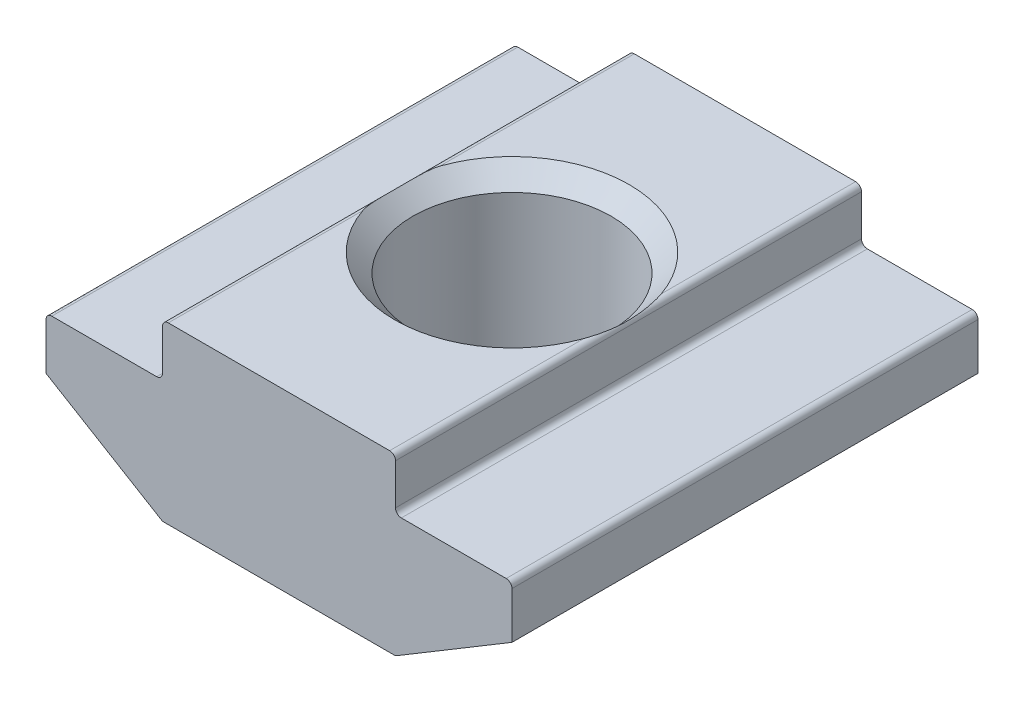
ISO-10303-21;
HEADER;
FILE_DESCRIPTION(('STEP AP214'),'2;1');
FILE_NAME('part.step','',(''),(''),'','','');
FILE_SCHEMA(('AUTOMOTIVE_DESIGN { 1 0 10303 214 1 1 1 1 }'));
ENDSEC;
DATA;
#1=APPLICATION_CONTEXT('core data for automotive mechanical design processes');
#2=APPLICATION_PROTOCOL_DEFINITION('international standard','automotive_design',2000,#1);
#3=PRODUCT_CONTEXT('',#1,'mechanical');
#4=PRODUCT('Part','Part','',(#3));
#5=PRODUCT_RELATED_PRODUCT_CATEGORY('part','',(#4));
#6=PRODUCT_DEFINITION_FORMATION('','',#4);
#7=PRODUCT_DEFINITION_CONTEXT('part definition',#1,'design');
#8=PRODUCT_DEFINITION('design','',#6,#7);
#9=PRODUCT_DEFINITION_SHAPE('','',#8);
#10=(LENGTH_UNIT() NAMED_UNIT(*) SI_UNIT(.MILLI.,.METRE.));
#11=(NAMED_UNIT(*) PLANE_ANGLE_UNIT() SI_UNIT($,.RADIAN.));
#12=(NAMED_UNIT(*) SI_UNIT($,.STERADIAN.) SOLID_ANGLE_UNIT());
#13=UNCERTAINTY_MEASURE_WITH_UNIT(LENGTH_MEASURE(1.E-05),#10,'distance_accuracy_value','');
#14=(GEOMETRIC_REPRESENTATION_CONTEXT(3) GLOBAL_UNCERTAINTY_ASSIGNED_CONTEXT((#13)) GLOBAL_UNIT_ASSIGNED_CONTEXT((#10,
#11,#12)) REPRESENTATION_CONTEXT('',''));
#15=CARTESIAN_POINT('',(0.,0.,0.));
#16=DIRECTION('',(0.,0.,1.));
#17=DIRECTION('',(1.,0.,0.));
#18=AXIS2_PLACEMENT_3D('',#15,#16,#17);
#19=CARTESIAN_POINT('',(-4.,-6.,8.));
#20=DIRECTION('',(0.,1.,0.));
#21=DIRECTION('',(0.,0.,1.));
#22=AXIS2_PLACEMENT_3D('',#19,#20,#21);
#23=PLANE('',#22);
#24=DIRECTION('',(1.,0.,0.));
#25=VECTOR('',#24,1.);
#26=CARTESIAN_POINT('',(-4.,-6.,-8.));
#27=LINE('',#26,#25);
#28=CARTESIAN_POINT('',(-3.94460320701031,-6.,-8.));
#29=VERTEX_POINT('',#28);
#30=CARTESIAN_POINT('',(3.94460320701031,-6.,-8.));
#31=VERTEX_POINT('',#30);
#32=EDGE_CURVE('E244',#29,#31,#27,.T.);
#33=ORIENTED_EDGE('',*,*,#32,.T.);
#34=DIRECTION('',(0.,0.,-1.));
#35=VECTOR('',#34,1.);
#36=CARTESIAN_POINT('',(3.94460320701031,-6.,-4.40022822840348));
#37=LINE('',#36,#35);
#38=CARTESIAN_POINT('',(3.94460320701031,-6.,-0.800456456806965));
#39=VERTEX_POINT('',#38);
#40=EDGE_CURVE('E285',#31,#39,#37,.F.);
#41=ORIENTED_EDGE('',*,*,#40,.T.);
#42=CARTESIAN_POINT('',(0.,-6.,0.));
#43=DIRECTION('',(0.,1.,0.));
#44=DIRECTION('',(0.,0.,1.));
#45=AXIS2_PLACEMENT_3D('',#42,#43,#44);
#46=CIRCLE('',#45,4.025);
#47=CARTESIAN_POINT('',(-3.94460320701031,-6.,-0.800456456806965));
#48=VERTEX_POINT('',#47);
#49=EDGE_CURVE('E266',#39,#48,#46,.T.);
#50=ORIENTED_EDGE('',*,*,#49,.T.);
#51=DIRECTION('',(0.,0.,-1.));
#52=VECTOR('',#51,1.);
#53=CARTESIAN_POINT('',(-3.94460320701031,-6.,-4.40022822840348));
#54=LINE('',#53,#52);
#55=EDGE_CURVE('E283',#48,#29,#54,.T.);
#56=ORIENTED_EDGE('',*,*,#55,.T.);
#57=EDGE_LOOP('',(#33,#41,#50,#56));
#58=FACE_BOUND('',#57,.T.);
#59=ADVANCED_FACE('F37',(#58),#23,.F.);
#60=CARTESIAN_POINT('',(4.,0.,8.));
#61=DIRECTION('',(0.,-1.,0.));
#62=DIRECTION('',(1.,0.,0.));
#63=AXIS2_PLACEMENT_3D('',#60,#61,#62);
#64=PLANE('',#63);
#65=CARTESIAN_POINT('',(0.,0.,0.));
#66=DIRECTION('',(0.,1.,0.));
#67=DIRECTION('',(0.,0.,1.));
#68=AXIS2_PLACEMENT_3D('',#65,#66,#67);
#69=CIRCLE('',#68,4.025);
#70=CARTESIAN_POINT('',(3.8,0.,-1.32688545097156));
#71=VERTEX_POINT('',#70);
#72=CARTESIAN_POINT('',(-3.8,0.,-1.32688545097156));
#73=VERTEX_POINT('',#72);
#74=EDGE_CURVE('E267',#71,#73,#69,.T.);
#75=ORIENTED_EDGE('',*,*,#74,.F.);
#76=DIRECTION('',(0.,0.,-1.));
#77=VECTOR('',#76,1.);
#78=CARTESIAN_POINT('',(3.8,0.,-4.66344272548578));
#79=LINE('',#78,#77);
#80=CARTESIAN_POINT('',(3.8,0.,-8.));
#81=VERTEX_POINT('',#80);
#82=EDGE_CURVE('E482',#71,#81,#79,.T.);
#83=ORIENTED_EDGE('',*,*,#82,.T.);
#84=DIRECTION('',(-1.,0.,0.));
#85=VECTOR('',#84,1.);
#86=CARTESIAN_POINT('',(4.,0.,-8.));
#87=LINE('',#86,#85);
#88=CARTESIAN_POINT('',(-3.8,0.,-8.));
#89=VERTEX_POINT('',#88);
#90=EDGE_CURVE('E258',#81,#89,#87,.T.);
#91=ORIENTED_EDGE('',*,*,#90,.T.);
#92=DIRECTION('',(0.,0.,-1.));
#93=VECTOR('',#92,1.);
#94=CARTESIAN_POINT('',(-3.8,0.,-4.66344272548578));
#95=LINE('',#94,#93);
#96=EDGE_CURVE('E52',#89,#73,#95,.F.);
#97=ORIENTED_EDGE('',*,*,#96,.T.);
#98=EDGE_LOOP('',(#75,#83,#91,#97));
#99=FACE_BOUND('',#98,.T.);
#100=ADVANCED_FACE('F322',(#99),#64,.F.);
#101=DIRECTION('',(-1.,0.,0.));
#102=VECTOR('',#101,1.);
#103=CARTESIAN_POINT('',(4.,0.,8.));
#104=LINE('',#103,#102);
#105=CARTESIAN_POINT('',(3.8,0.,8.));
#106=VERTEX_POINT('',#105);
#107=CARTESIAN_POINT('',(-3.8,0.,8.));
#108=VERTEX_POINT('',#107);
#109=EDGE_CURVE('E231',#106,#108,#104,.T.);
#110=ORIENTED_EDGE('',*,*,#109,.F.);
#111=DIRECTION('',(0.,0.,-1.));
#112=VECTOR('',#111,1.);
#113=CARTESIAN_POINT('',(3.8,0.,8.));
#114=LINE('',#113,#112);
#115=CARTESIAN_POINT('',(3.8,0.,1.32688545097156));
#116=VERTEX_POINT('',#115);
#117=EDGE_CURVE('E416',#106,#116,#114,.T.);
#118=ORIENTED_EDGE('',*,*,#117,.T.);
#119=CARTESIAN_POINT('',(-3.8,0.,1.32688545097156));
#120=VERTEX_POINT('',#119);
#121=EDGE_CURVE('E209',#120,#116,#69,.T.);
#122=ORIENTED_EDGE('',*,*,#121,.F.);
#123=DIRECTION('',(0.,0.,-1.));
#124=VECTOR('',#123,1.);
#125=CARTESIAN_POINT('',(-3.8,0.,8.));
#126=LINE('',#125,#124);
#127=EDGE_CURVE('E414',#120,#108,#126,.F.);
#128=ORIENTED_EDGE('',*,*,#127,.T.);
#129=EDGE_LOOP('',(#110,#118,#122,#128));
#130=FACE_BOUND('',#129,.T.);
#131=ADVANCED_FACE('F325',(#130),#64,.F.);
#132=CARTESIAN_POINT('',(-4.,0.,8.));
#133=DIRECTION('',(1.,0.,0.));
#134=DIRECTION('',(0.,0.,-1.));
#135=AXIS2_PLACEMENT_3D('',#132,#133,#134);
#136=PLANE('',#135);
#137=DIRECTION('',(0.,-1.,0.));
#138=VECTOR('',#137,1.);
#139=CARTESIAN_POINT('',(-4.,0.,8.));
#140=LINE('',#139,#138);
#141=CARTESIAN_POINT('',(-4.,-0.200000000000002,8.));
#142=VERTEX_POINT('',#141);
#143=CARTESIAN_POINT('',(-4.,-1.6,8.));
#144=VERTEX_POINT('',#143);
#145=EDGE_CURVE('E260',#142,#144,#140,.T.);
#146=ORIENTED_EDGE('',*,*,#145,.F.);
#147=DIRECTION('',(0.,0.,-1.));
#148=VECTOR('',#147,1.);
#149=CARTESIAN_POINT('',(-4.,-0.200000000000002,8.));
#150=LINE('',#149,#148);
#151=CARTESIAN_POINT('',(-4.,-0.200000000000002,-8.));
#152=VERTEX_POINT('',#151);
#153=EDGE_CURVE('E463',#142,#152,#150,.T.);
#154=ORIENTED_EDGE('',*,*,#153,.T.);
#155=DIRECTION('',(0.,-1.,0.));
#156=VECTOR('',#155,1.);
#157=CARTESIAN_POINT('',(-4.,0.,-8.));
#158=LINE('',#157,#156);
#159=CARTESIAN_POINT('',(-4.,-1.6,-8.));
#160=VERTEX_POINT('',#159);
#161=EDGE_CURVE('E234',#152,#160,#158,.T.);
#162=ORIENTED_EDGE('',*,*,#161,.T.);
#163=DIRECTION('',(0.,0.,-1.));
#164=VECTOR('',#163,1.);
#165=CARTESIAN_POINT('',(-4.,-1.6,8.));
#166=LINE('',#165,#164);
#167=EDGE_CURVE('E467',#160,#144,#166,.F.);
#168=ORIENTED_EDGE('',*,*,#167,.T.);
#169=EDGE_LOOP('',(#146,#154,#162,#168));
#170=FACE_BOUND('',#169,.T.);
#171=ADVANCED_FACE('F352',(#170),#136,.F.);
#172=CARTESIAN_POINT('',(-4.,-1.8,8.));
#173=DIRECTION('',(0.,-1.,0.));
#174=DIRECTION('',(1.,0.,0.));
#175=AXIS2_PLACEMENT_3D('',#172,#173,#174);
#176=PLANE('',#175);
#177=DIRECTION('',(-1.,0.,0.));
#178=VECTOR('',#177,1.);
#179=CARTESIAN_POINT('',(-4.,-1.8,-8.));
#180=LINE('',#179,#178);
#181=CARTESIAN_POINT('',(-4.2,-1.8,-8.));
#182=VERTEX_POINT('',#181);
#183=CARTESIAN_POINT('',(-7.8,-1.8,-8.));
#184=VERTEX_POINT('',#183);
#185=EDGE_CURVE('E237',#182,#184,#180,.T.);
#186=ORIENTED_EDGE('',*,*,#185,.T.);
#187=DIRECTION('',(0.,0.,-1.));
#188=VECTOR('',#187,1.);
#189=CARTESIAN_POINT('',(-7.8,-1.8,8.));
#190=LINE('',#189,#188);
#191=CARTESIAN_POINT('',(-7.8,-1.8,8.));
#192=VERTEX_POINT('',#191);
#193=EDGE_CURVE('E460',#184,#192,#190,.F.);
#194=ORIENTED_EDGE('',*,*,#193,.T.);
#195=DIRECTION('',(-1.,0.,0.));
#196=VECTOR('',#195,1.);
#197=CARTESIAN_POINT('',(-4.,-1.8,8.));
#198=LINE('',#197,#196);
#199=CARTESIAN_POINT('',(-4.2,-1.8,8.));
#200=VERTEX_POINT('',#199);
#201=EDGE_CURVE('E199',#200,#192,#198,.T.);
#202=ORIENTED_EDGE('',*,*,#201,.F.);
#203=DIRECTION('',(0.,0.,-1.));
#204=VECTOR('',#203,1.);
#205=CARTESIAN_POINT('',(-4.2,-1.8,-8.));
#206=LINE('',#205,#204);
#207=EDGE_CURVE('E462',#200,#182,#206,.T.);
#208=ORIENTED_EDGE('',*,*,#207,.T.);
#209=EDGE_LOOP('',(#186,#194,#202,#208));
#210=FACE_BOUND('',#209,.T.);
#211=ADVANCED_FACE('F349',(#210),#176,.F.);
#212=CARTESIAN_POINT('',(-8.,-1.8,8.));
#213=DIRECTION('',(1.,0.,0.));
#214=DIRECTION('',(0.,0.,-1.));
#215=AXIS2_PLACEMENT_3D('',#212,#213,#214);
#216=PLANE('',#215);
#217=DIRECTION('',(0.,-1.,0.));
#218=VECTOR('',#217,1.);
#219=CARTESIAN_POINT('',(-8.,-1.8,8.));
#220=LINE('',#219,#218);
#221=CARTESIAN_POINT('',(-8.,-2.,8.));
#222=VERTEX_POINT('',#221);
#223=CARTESIAN_POINT('',(-8.,-3.6,8.));
#224=VERTEX_POINT('',#223);
#225=EDGE_CURVE('E186',#222,#224,#220,.T.);
#226=ORIENTED_EDGE('',*,*,#225,.F.);
#227=DIRECTION('',(0.,0.,-1.));
#228=VECTOR('',#227,1.);
#229=CARTESIAN_POINT('',(-8.,-2.,8.));
#230=LINE('',#229,#228);
#231=CARTESIAN_POINT('',(-8.,-2.,-8.));
#232=VERTEX_POINT('',#231);
#233=EDGE_CURVE('E461',#222,#232,#230,.T.);
#234=ORIENTED_EDGE('',*,*,#233,.T.);
#235=DIRECTION('',(0.,-1.,0.));
#236=VECTOR('',#235,1.);
#237=CARTESIAN_POINT('',(-8.,-1.8,-8.));
#238=LINE('',#237,#236);
#239=CARTESIAN_POINT('',(-8.,-3.6,-8.));
#240=VERTEX_POINT('',#239);
#241=EDGE_CURVE('E205',#232,#240,#238,.T.);
#242=ORIENTED_EDGE('',*,*,#241,.T.);
#243=DIRECTION('',(0.,0.,-1.));
#244=VECTOR('',#243,1.);
#245=CARTESIAN_POINT('',(-8.,-3.6,8.));
#246=LINE('',#245,#244);
#247=EDGE_CURVE('E202',#224,#240,#246,.T.);
#248=ORIENTED_EDGE('',*,*,#247,.F.);
#249=EDGE_LOOP('',(#226,#234,#242,#248));
#250=FACE_BOUND('',#249,.T.);
#251=ADVANCED_FACE('F203',(#250),#216,.F.);
#252=CARTESIAN_POINT('',(-8.,-3.6,8.));
#253=DIRECTION('',(0.514495755427527,0.857492925712544,0.));
#254=DIRECTION('',(-0.857492925712544,0.514495755427527,0.));
#255=AXIS2_PLACEMENT_3D('',#252,#253,#254);
#256=PLANE('',#255);
#257=DIRECTION('',(0.857492925712544,-0.514495755427527,0.));
#258=VECTOR('',#257,1.);
#259=CARTESIAN_POINT('',(-8.,-3.6,-8.));
#260=LINE('',#259,#258);
#261=CARTESIAN_POINT('',(-4.04750235809582,-5.97149858514251,-8.));
#262=VERTEX_POINT('',#261);
#263=EDGE_CURVE('E242',#240,#262,#260,.T.);
#264=ORIENTED_EDGE('',*,*,#263,.T.);
#265=DIRECTION('',(0.,0.,-1.));
#266=VECTOR('',#265,1.);
#267=CARTESIAN_POINT('',(-4.04750235809582,-5.97149858514251,8.));
#268=LINE('',#267,#266);
#269=CARTESIAN_POINT('',(-4.04750235809582,-5.97149858514251,8.));
#270=VERTEX_POINT('',#269);
#271=EDGE_CURVE('E214',#262,#270,#268,.F.);
#272=ORIENTED_EDGE('',*,*,#271,.T.);
#273=DIRECTION('',(0.857492925712544,-0.514495755427527,0.));
#274=VECTOR('',#273,1.);
#275=CARTESIAN_POINT('',(-8.,-3.6,8.));
#276=LINE('',#275,#274);
#277=EDGE_CURVE('E191',#224,#270,#276,.T.);
#278=ORIENTED_EDGE('',*,*,#277,.F.);
#279=ORIENTED_EDGE('',*,*,#247,.T.);
#280=EDGE_LOOP('',(#264,#272,#278,#279));
#281=FACE_BOUND('',#280,.T.);
#282=ADVANCED_FACE('F212',(#281),#256,.F.);
#283=CARTESIAN_POINT('',(-3.94460320701031,-6.,0.800456456806965));
#284=VERTEX_POINT('',#283);
#285=CARTESIAN_POINT('',(3.94460320701031,-6.,0.800456456806965));
#286=VERTEX_POINT('',#285);
#287=EDGE_CURVE('E263',#284,#286,#46,.T.);
#288=ORIENTED_EDGE('',*,*,#287,.T.);
#289=DIRECTION('',(0.,0.,-1.));
#290=VECTOR('',#289,1.);
#291=CARTESIAN_POINT('',(3.94460320701031,-6.,8.));
#292=LINE('',#291,#290);
#293=CARTESIAN_POINT('',(3.94460320701031,-6.,8.));
#294=VERTEX_POINT('',#293);
#295=EDGE_CURVE('E381',#286,#294,#292,.F.);
#296=ORIENTED_EDGE('',*,*,#295,.T.);
#297=DIRECTION('',(1.,0.,0.));
#298=VECTOR('',#297,1.);
#299=CARTESIAN_POINT('',(-4.,-6.,8.));
#300=LINE('',#299,#298);
#301=CARTESIAN_POINT('',(-3.94460320701031,-6.,8.));
#302=VERTEX_POINT('',#301);
#303=EDGE_CURVE('E215',#302,#294,#300,.T.);
#304=ORIENTED_EDGE('',*,*,#303,.F.);
#305=DIRECTION('',(0.,0.,-1.));
#306=VECTOR('',#305,1.);
#307=CARTESIAN_POINT('',(-3.94460320701031,-6.,8.));
#308=LINE('',#307,#306);
#309=EDGE_CURVE('E384',#302,#284,#308,.T.);
#310=ORIENTED_EDGE('',*,*,#309,.T.);
#311=EDGE_LOOP('',(#288,#296,#304,#310));
#312=FACE_BOUND('',#311,.T.);
#313=ADVANCED_FACE('F340',(#312),#23,.F.);
#314=CARTESIAN_POINT('',(8.,-3.6,8.));
#315=DIRECTION('',(-0.514495755427527,0.857492925712544,0.));
#316=DIRECTION('',(-0.857492925712544,-0.514495755427527,0.));
#317=AXIS2_PLACEMENT_3D('',#314,#315,#316);
#318=PLANE('',#317);
#319=DIRECTION('',(0.857492925712544,0.514495755427527,0.));
#320=VECTOR('',#319,1.);
#321=CARTESIAN_POINT('',(8.,-3.6,8.));
#322=LINE('',#321,#320);
#323=CARTESIAN_POINT('',(4.04750235809582,-5.97149858514251,8.));
#324=VERTEX_POINT('',#323);
#325=CARTESIAN_POINT('',(8.,-3.6,8.));
#326=VERTEX_POINT('',#325);
#327=EDGE_CURVE('E217',#324,#326,#322,.T.);
#328=ORIENTED_EDGE('',*,*,#327,.F.);
#329=DIRECTION('',(0.,0.,-1.));
#330=VECTOR('',#329,1.);
#331=CARTESIAN_POINT('',(4.04750235809582,-5.97149858514251,8.));
#332=LINE('',#331,#330);
#333=CARTESIAN_POINT('',(4.04750235809582,-5.97149858514251,-8.));
#334=VERTEX_POINT('',#333);
#335=EDGE_CURVE('E268',#324,#334,#332,.T.);
#336=ORIENTED_EDGE('',*,*,#335,.T.);
#337=DIRECTION('',(0.857492925712544,0.514495755427527,0.));
#338=VECTOR('',#337,1.);
#339=CARTESIAN_POINT('',(8.,-3.6,-8.));
#340=LINE('',#339,#338);
#341=CARTESIAN_POINT('',(8.,-3.6,-8.));
#342=VERTEX_POINT('',#341);
#343=EDGE_CURVE('E247',#334,#342,#340,.T.);
#344=ORIENTED_EDGE('',*,*,#343,.T.);
#345=DIRECTION('',(0.,0.,-1.));
#346=VECTOR('',#345,1.);
#347=CARTESIAN_POINT('',(8.,-3.6,8.));
#348=LINE('',#347,#346);
#349=EDGE_CURVE('E210',#326,#342,#348,.T.);
#350=ORIENTED_EDGE('',*,*,#349,.F.);
#351=EDGE_LOOP('',(#328,#336,#344,#350));
#352=FACE_BOUND('',#351,.T.);
#353=ADVANCED_FACE('F336',(#352),#318,.F.);
#354=CARTESIAN_POINT('',(8.,-1.8,8.));
#355=DIRECTION('',(-1.,0.,0.));
#356=DIRECTION('',(0.,0.,1.));
#357=AXIS2_PLACEMENT_3D('',#354,#355,#356);
#358=PLANE('',#357);
#359=DIRECTION('',(0.,1.,0.));
#360=VECTOR('',#359,1.);
#361=CARTESIAN_POINT('',(8.,-1.8,-8.));
#362=LINE('',#361,#360);
#363=CARTESIAN_POINT('',(8.,-2.,-8.));
#364=VERTEX_POINT('',#363);
#365=EDGE_CURVE('E249',#342,#364,#362,.T.);
#366=ORIENTED_EDGE('',*,*,#365,.T.);
#367=DIRECTION('',(0.,0.,-1.));
#368=VECTOR('',#367,1.);
#369=CARTESIAN_POINT('',(8.,-2.,8.));
#370=LINE('',#369,#368);
#371=CARTESIAN_POINT('',(8.,-2.,8.));
#372=VERTEX_POINT('',#371);
#373=EDGE_CURVE('E407',#364,#372,#370,.F.);
#374=ORIENTED_EDGE('',*,*,#373,.T.);
#375=DIRECTION('',(0.,1.,0.));
#376=VECTOR('',#375,1.);
#377=CARTESIAN_POINT('',(8.,-1.8,8.));
#378=LINE('',#377,#376);
#379=EDGE_CURVE('E222',#326,#372,#378,.T.);
#380=ORIENTED_EDGE('',*,*,#379,.F.);
#381=ORIENTED_EDGE('',*,*,#349,.T.);
#382=EDGE_LOOP('',(#366,#374,#380,#381));
#383=FACE_BOUND('',#382,.T.);
#384=ADVANCED_FACE('F332',(#383),#358,.F.);
#385=CARTESIAN_POINT('',(4.,-1.8,8.));
#386=DIRECTION('',(0.,-1.,0.));
#387=DIRECTION('',(1.,0.,0.));
#388=AXIS2_PLACEMENT_3D('',#385,#386,#387);
#389=PLANE('',#388);
#390=DIRECTION('',(-1.,0.,0.));
#391=VECTOR('',#390,1.);
#392=CARTESIAN_POINT('',(4.,-1.8,8.));
#393=LINE('',#392,#391);
#394=CARTESIAN_POINT('',(7.8,-1.8,8.));
#395=VERTEX_POINT('',#394);
#396=CARTESIAN_POINT('',(4.2,-1.8,8.));
#397=VERTEX_POINT('',#396);
#398=EDGE_CURVE('E225',#395,#397,#393,.T.);
#399=ORIENTED_EDGE('',*,*,#398,.F.);
#400=DIRECTION('',(0.,0.,-1.));
#401=VECTOR('',#400,1.);
#402=CARTESIAN_POINT('',(7.8,-1.8,8.));
#403=LINE('',#402,#401);
#404=CARTESIAN_POINT('',(7.8,-1.8,-8.));
#405=VERTEX_POINT('',#404);
#406=EDGE_CURVE('E404',#395,#405,#403,.T.);
#407=ORIENTED_EDGE('',*,*,#406,.T.);
#408=DIRECTION('',(-1.,0.,0.));
#409=VECTOR('',#408,1.);
#410=CARTESIAN_POINT('',(4.,-1.8,-8.));
#411=LINE('',#410,#409);
#412=CARTESIAN_POINT('',(4.2,-1.8,-8.));
#413=VERTEX_POINT('',#412);
#414=EDGE_CURVE('E252',#405,#413,#411,.T.);
#415=ORIENTED_EDGE('',*,*,#414,.T.);
#416=DIRECTION('',(0.,0.,-1.));
#417=VECTOR('',#416,1.);
#418=CARTESIAN_POINT('',(4.2,-1.8,8.));
#419=LINE('',#418,#417);
#420=EDGE_CURVE('E402',#413,#397,#419,.F.);
#421=ORIENTED_EDGE('',*,*,#420,.T.);
#422=EDGE_LOOP('',(#399,#407,#415,#421));
#423=FACE_BOUND('',#422,.T.);
#424=ADVANCED_FACE('F328',(#423),#389,.F.);
#425=CARTESIAN_POINT('',(4.,0.,8.));
#426=DIRECTION('',(-1.,0.,0.));
#427=DIRECTION('',(0.,0.,1.));
#428=AXIS2_PLACEMENT_3D('',#425,#426,#427);
#429=PLANE('',#428);
#430=DIRECTION('',(0.,1.,0.));
#431=VECTOR('',#430,1.);
#432=CARTESIAN_POINT('',(4.,0.,8.));
#433=LINE('',#432,#431);
#434=CARTESIAN_POINT('',(4.,-1.6,8.));
#435=VERTEX_POINT('',#434);
#436=CARTESIAN_POINT('',(4.,-0.199999999999998,8.));
#437=VERTEX_POINT('',#436);
#438=EDGE_CURVE('E228',#435,#437,#433,.T.);
#439=ORIENTED_EDGE('',*,*,#438,.F.);
#440=DIRECTION('',(0.,0.,-1.));
#441=VECTOR('',#440,1.);
#442=CARTESIAN_POINT('',(4.,-1.6,-8.));
#443=LINE('',#442,#441);
#444=CARTESIAN_POINT('',(4.,-1.6,-8.));
#445=VERTEX_POINT('',#444);
#446=EDGE_CURVE('E411',#435,#445,#443,.T.);
#447=ORIENTED_EDGE('',*,*,#446,.T.);
#448=DIRECTION('',(0.,1.,0.));
#449=VECTOR('',#448,1.);
#450=CARTESIAN_POINT('',(4.,0.,-8.));
#451=LINE('',#450,#449);
#452=CARTESIAN_POINT('',(4.,-0.199999999999998,-8.));
#453=VERTEX_POINT('',#452);
#454=EDGE_CURVE('E255',#445,#453,#451,.T.);
#455=ORIENTED_EDGE('',*,*,#454,.T.);
#456=DIRECTION('',(0.,0.,-1.));
#457=VECTOR('',#456,1.);
#458=CARTESIAN_POINT('',(4.,-0.199999999999998,8.));
#459=LINE('',#458,#457);
#460=EDGE_CURVE('E409',#453,#437,#459,.F.);
#461=ORIENTED_EDGE('',*,*,#460,.T.);
#462=EDGE_LOOP('',(#439,#447,#455,#461));
#463=FACE_BOUND('',#462,.T.);
#464=ADVANCED_FACE('F318',(#463),#429,.F.);
#465=CARTESIAN_POINT('',(0.,0.,8.));
#466=DIRECTION('',(0.,0.,-1.));
#467=DIRECTION('',(-1.,0.,0.));
#468=AXIS2_PLACEMENT_3D('',#465,#466,#467);
#469=PLANE('',#468);
#470=ORIENTED_EDGE('',*,*,#303,.T.);
#471=CARTESIAN_POINT('',(3.94460320701031,-5.8,8.));
#472=DIRECTION('',(0.,0.,-1.));
#473=DIRECTION('',(-1.,0.,0.));
#474=AXIS2_PLACEMENT_3D('',#471,#472,#473);
#475=CIRCLE('',#474,0.2);
#476=EDGE_CURVE('E399',#294,#324,#475,.F.);
#477=ORIENTED_EDGE('',*,*,#476,.T.);
#478=ORIENTED_EDGE('',*,*,#327,.T.);
#479=ORIENTED_EDGE('',*,*,#379,.T.);
#480=CARTESIAN_POINT('',(7.8,-2.,8.));
#481=DIRECTION('',(0.,0.,-1.));
#482=DIRECTION('',(-1.,0.,0.));
#483=AXIS2_PLACEMENT_3D('',#480,#481,#482);
#484=CIRCLE('',#483,0.2);
#485=EDGE_CURVE('E395',#372,#395,#484,.F.);
#486=ORIENTED_EDGE('',*,*,#485,.T.);
#487=ORIENTED_EDGE('',*,*,#398,.T.);
#488=CARTESIAN_POINT('',(4.2,-1.6,8.));
#489=DIRECTION('',(0.,0.,-1.));
#490=DIRECTION('',(-1.,0.,0.));
#491=AXIS2_PLACEMENT_3D('',#488,#489,#490);
#492=CIRCLE('',#491,0.2);
#493=EDGE_CURVE('E474',#397,#435,#492,.T.);
#494=ORIENTED_EDGE('',*,*,#493,.T.);
#495=ORIENTED_EDGE('',*,*,#438,.T.);
#496=CARTESIAN_POINT('',(3.8,-0.199999999999998,8.));
#497=DIRECTION('',(0.,0.,-1.));
#498=DIRECTION('',(-1.,0.,0.));
#499=AXIS2_PLACEMENT_3D('',#496,#497,#498);
#500=CIRCLE('',#499,0.2);
#501=EDGE_CURVE('E393',#437,#106,#500,.F.);
#502=ORIENTED_EDGE('',*,*,#501,.T.);
#503=ORIENTED_EDGE('',*,*,#109,.T.);
#504=CARTESIAN_POINT('',(-3.8,-0.200000000000002,8.));
#505=DIRECTION('',(0.,0.,-1.));
#506=DIRECTION('',(-1.,0.,0.));
#507=AXIS2_PLACEMENT_3D('',#504,#505,#506);
#508=CIRCLE('',#507,0.2);
#509=EDGE_CURVE('E391',#108,#142,#508,.F.);
#510=ORIENTED_EDGE('',*,*,#509,.T.);
#511=ORIENTED_EDGE('',*,*,#145,.T.);
#512=CARTESIAN_POINT('',(-4.2,-1.6,8.));
#513=DIRECTION('',(0.,0.,-1.));
#514=DIRECTION('',(-1.,0.,0.));
#515=AXIS2_PLACEMENT_3D('',#512,#513,#514);
#516=CIRCLE('',#515,0.2);
#517=EDGE_CURVE('E11',#144,#200,#516,.T.);
#518=ORIENTED_EDGE('',*,*,#517,.T.);
#519=ORIENTED_EDGE('',*,*,#201,.T.);
#520=CARTESIAN_POINT('',(-7.8,-2.,8.));
#521=DIRECTION('',(0.,0.,-1.));
#522=DIRECTION('',(-1.,0.,0.));
#523=AXIS2_PLACEMENT_3D('',#520,#521,#522);
#524=CIRCLE('',#523,0.2);
#525=EDGE_CURVE('E195',#192,#222,#524,.F.);
#526=ORIENTED_EDGE('',*,*,#525,.T.);
#527=ORIENTED_EDGE('',*,*,#225,.T.);
#528=ORIENTED_EDGE('',*,*,#277,.T.);
#529=CARTESIAN_POINT('',(-3.94460320701031,-5.8,8.));
#530=DIRECTION('',(0.,0.,-1.));
#531=DIRECTION('',(-1.,0.,0.));
#532=AXIS2_PLACEMENT_3D('',#529,#530,#531);
#533=CIRCLE('',#532,0.2);
#534=EDGE_CURVE('E397',#270,#302,#533,.F.);
#535=ORIENTED_EDGE('',*,*,#534,.T.);
#536=EDGE_LOOP('',(#470,#477,#478,#479,#486,#487,#494,#495,#502,#503,#510,#511,#518,#519,#526,
#527,#528,#535));
#537=FACE_BOUND('',#536,.T.);
#538=ADVANCED_FACE('F189',(#537),#469,.F.);
#539=CARTESIAN_POINT('',(0.,0.,-8.));
#540=DIRECTION('',(0.,0.,-1.));
#541=DIRECTION('',(-1.,0.,0.));
#542=AXIS2_PLACEMENT_3D('',#539,#540,#541);
#543=PLANE('',#542);
#544=ORIENTED_EDGE('',*,*,#343,.F.);
#545=CARTESIAN_POINT('',(3.94460320701031,-5.8,-8.));
#546=DIRECTION('',(0.,0.,-1.));
#547=DIRECTION('',(-1.,0.,0.));
#548=AXIS2_PLACEMENT_3D('',#545,#546,#547);
#549=CIRCLE('',#548,0.2);
#550=EDGE_CURVE('E281',#334,#31,#549,.T.);
#551=ORIENTED_EDGE('',*,*,#550,.T.);
#552=ORIENTED_EDGE('',*,*,#32,.F.);
#553=CARTESIAN_POINT('',(-3.94460320701031,-5.8,-8.));
#554=DIRECTION('',(0.,0.,-1.));
#555=DIRECTION('',(-1.,0.,0.));
#556=AXIS2_PLACEMENT_3D('',#553,#554,#555);
#557=CIRCLE('',#556,0.2);
#558=EDGE_CURVE('E279',#29,#262,#557,.T.);
#559=ORIENTED_EDGE('',*,*,#558,.T.);
#560=ORIENTED_EDGE('',*,*,#263,.F.);
#561=ORIENTED_EDGE('',*,*,#241,.F.);
#562=CARTESIAN_POINT('',(-7.8,-2.,-8.));
#563=DIRECTION('',(0.,0.,-1.));
#564=DIRECTION('',(-1.,0.,0.));
#565=AXIS2_PLACEMENT_3D('',#562,#563,#564);
#566=CIRCLE('',#565,0.2);
#567=EDGE_CURVE('E271',#232,#184,#566,.T.);
#568=ORIENTED_EDGE('',*,*,#567,.T.);
#569=ORIENTED_EDGE('',*,*,#185,.F.);
#570=CARTESIAN_POINT('',(-4.2,-1.6,-8.));
#571=DIRECTION('',(0.,0.,-1.));
#572=DIRECTION('',(-1.,0.,0.));
#573=AXIS2_PLACEMENT_3D('',#570,#571,#572);
#574=CIRCLE('',#573,0.2);
#575=EDGE_CURVE('E45',#182,#160,#574,.F.);
#576=ORIENTED_EDGE('',*,*,#575,.T.);
#577=ORIENTED_EDGE('',*,*,#161,.F.);
#578=CARTESIAN_POINT('',(-3.8,-0.200000000000002,-8.));
#579=DIRECTION('',(0.,0.,-1.));
#580=DIRECTION('',(-1.,0.,0.));
#581=AXIS2_PLACEMENT_3D('',#578,#579,#580);
#582=CIRCLE('',#581,0.2);
#583=EDGE_CURVE('E273',#152,#89,#582,.T.);
#584=ORIENTED_EDGE('',*,*,#583,.T.);
#585=ORIENTED_EDGE('',*,*,#90,.F.);
#586=CARTESIAN_POINT('',(3.8,-0.199999999999998,-8.));
#587=DIRECTION('',(0.,0.,-1.));
#588=DIRECTION('',(-1.,0.,0.));
#589=AXIS2_PLACEMENT_3D('',#586,#587,#588);
#590=CIRCLE('',#589,0.2);
#591=EDGE_CURVE('E275',#81,#453,#590,.T.);
#592=ORIENTED_EDGE('',*,*,#591,.T.);
#593=ORIENTED_EDGE('',*,*,#454,.F.);
#594=CARTESIAN_POINT('',(4.2,-1.6,-8.));
#595=DIRECTION('',(0.,0.,-1.));
#596=DIRECTION('',(-1.,0.,0.));
#597=AXIS2_PLACEMENT_3D('',#594,#595,#596);
#598=CIRCLE('',#597,0.2);
#599=EDGE_CURVE('E472',#445,#413,#598,.F.);
#600=ORIENTED_EDGE('',*,*,#599,.T.);
#601=ORIENTED_EDGE('',*,*,#414,.F.);
#602=CARTESIAN_POINT('',(7.8,-2.,-8.));
#603=DIRECTION('',(0.,0.,-1.));
#604=DIRECTION('',(-1.,0.,0.));
#605=AXIS2_PLACEMENT_3D('',#602,#603,#604);
#606=CIRCLE('',#605,0.2);
#607=EDGE_CURVE('E277',#405,#364,#606,.T.);
#608=ORIENTED_EDGE('',*,*,#607,.T.);
#609=ORIENTED_EDGE('',*,*,#365,.F.);
#610=EDGE_LOOP('',(#544,#551,#552,#559,#560,#561,#568,#569,#576,#577,#584,#585,#592,#593,#600,
#601,#608,#609));
#611=FACE_BOUND('',#610,.T.);
#612=ADVANCED_FACE('F311',(#611),#543,.T.);
#613=CARTESIAN_POINT('',(0.,-5.375,0.));
#614=DIRECTION('',(0.,-1.,0.));
#615=DIRECTION('',(0.,0.,-1.));
#616=AXIS2_PLACEMENT_3D('',#613,#614,#615);
#617=CONICAL_SURFACE('',#616,3.4,0.785398163397446);
#618=CARTESIAN_POINT('',(0.,-5.375,0.));
#619=DIRECTION('',(0.,1.,0.));
#620=DIRECTION('',(0.,0.,1.));
#621=AXIS2_PLACEMENT_3D('',#618,#619,#620);
#622=CIRCLE('',#621,3.4);
#623=CARTESIAN_POINT('',(0.,-5.375,3.4));
#624=VERTEX_POINT('',#623);
#625=EDGE_CURVE('E238',#624,#624,#622,.T.);
#626=ORIENTED_EDGE('',*,*,#625,.T.);
#627=EDGE_LOOP('',(#626));
#628=FACE_BOUND('',#627,.T.);
#629=ORIENTED_EDGE('',*,*,#49,.F.);
#630=CARTESIAN_POINT('',(3.94460320701031,-6.,-0.800456456806965));
#631=CARTESIAN_POINT('',(3.95124665807427,-5.99997629212674,-0.767598927661148));
#632=CARTESIAN_POINT('',(3.95719990675475,-5.99966968554478,-0.734614152048833));
#633=CARTESIAN_POINT('',(3.96793701176,-5.99871329066053,-0.668480055491083));
#634=CARTESIAN_POINT('',(3.97272162507351,-5.99806372537811,-0.635330855328869));
#635=CARTESIAN_POINT('',(3.98132356516102,-5.99664621850902,-0.569045833698919));
#636=CARTESIAN_POINT('',(3.98514462865294,-5.99587875339307,-0.535910474082957));
#637=CARTESIAN_POINT('',(3.99196227117348,-5.99434362624559,-0.469545354323605));
#638=CARTESIAN_POINT('',(3.99495859553964,-5.99357596422634,-0.436315568216108));
#639=CARTESIAN_POINT('',(4.00152646336617,-5.99177225640401,-0.353193697791942));
#640=CARTESIAN_POINT('',(4.00463859237817,-5.99079351010962,-0.303263843510857));
#641=CARTESIAN_POINT('',(4.00939107612372,-5.98923169407833,-0.20332598296382));
#642=CARTESIAN_POINT('',(4.01103131999685,-5.98864865414632,-0.153317971095259));
#643=CARTESIAN_POINT('',(4.01292832425611,-5.98796994197333,-0.0532678826838055));
#644=CARTESIAN_POINT('',(4.01318495826876,-5.98787431425069,-0.0032258034467993));
#645=CARTESIAN_POINT('',(4.01232816344706,-5.98818483234974,0.0968450210015113));
#646=CARTESIAN_POINT('',(4.01121473545537,-5.98859097786281,0.146873766220998));
#647=CARTESIAN_POINT('',(4.00753612643109,-5.98985087837817,0.247478383970289));
#648=CARTESIAN_POINT('',(4.00495357239189,-5.990709980716,0.298053566068647));
#649=CARTESIAN_POINT('',(3.99817500007191,-5.99272416200122,0.399081412253452));
#650=CARTESIAN_POINT('',(3.99397927670538,-5.99387918683618,0.449534097038875));
#651=CARTESIAN_POINT('',(3.98370690865607,-5.9962122515486,0.550262615026358));
#652=CARTESIAN_POINT('',(3.97762996003312,-5.99739029511625,0.600538418322108));
#653=CARTESIAN_POINT('',(3.96674252117646,-5.99880438090822,0.675719601650648));
#654=CARTESIAN_POINT('',(3.96281647922891,-5.9992169893502,0.700749315426253));
#655=CARTESIAN_POINT('',(3.9542631645755,-5.9998106822356,0.750696987983326));
#656=CARTESIAN_POINT('',(3.94963572050252,-5.99999170999671,0.775614917917657));
#657=CARTESIAN_POINT('',(3.94460320701031,-6.,0.800456456806965));
#658=B_SPLINE_CURVE_WITH_KNOTS('',3,(#630,#631,#632,#633,#634,#635,#636,#637,#638,#639,#640,
#641,#642,#643,#644,#645,#646,#647,#648,#649,#650,#651,#652,#653,#654,#655,#656,#657),
.UNSPECIFIED.,.F.,.F.,(4,2,2,2,2,2,2,2,2,2,2,2,2,4),(0.,0.100541792518917,0.201018284893462,
0.301098912494255,0.401210408353149,0.551292502615055,0.701385899909962,0.851493005911204,
1.00160001958807,1.15352014778547,1.30541251564852,1.45732943682253,1.53333717266716,
1.60936350880561),.UNSPECIFIED.);
#659=EDGE_CURVE('E295',#39,#286,#658,.T.);
#660=ORIENTED_EDGE('',*,*,#659,.T.);
#661=ORIENTED_EDGE('',*,*,#287,.F.);
#662=CARTESIAN_POINT('',(-3.94460320701031,-6.,0.800456456806965));
#663=CARTESIAN_POINT('',(-3.95124665807427,-5.99997629212674,0.767598927661148));
#664=CARTESIAN_POINT('',(-3.95719990675475,-5.99966968554478,0.734614152048833));
#665=CARTESIAN_POINT('',(-3.96793701176,-5.99871329066053,0.668480055491083));
#666=CARTESIAN_POINT('',(-3.97272162507351,-5.99806372537811,0.635330855328869));
#667=CARTESIAN_POINT('',(-3.98132356516102,-5.99664621850902,0.569045833698919));
#668=CARTESIAN_POINT('',(-3.98514462865294,-5.99587875339307,0.535910474082957));
#669=CARTESIAN_POINT('',(-3.99196227117348,-5.99434362624559,0.469545354323605));
#670=CARTESIAN_POINT('',(-3.99495859553964,-5.99357596422634,0.436315568216108));
#671=CARTESIAN_POINT('',(-4.00152646336617,-5.99177225640401,0.353193697791942));
#672=CARTESIAN_POINT('',(-4.00463859237817,-5.99079351010962,0.303263843510857));
#673=CARTESIAN_POINT('',(-4.00939107612372,-5.98923169407833,0.20332598296382));
#674=CARTESIAN_POINT('',(-4.01103131999685,-5.98864865414632,0.153317971095259));
#675=CARTESIAN_POINT('',(-4.01292832425611,-5.98796994197333,0.0532678826838055));
#676=CARTESIAN_POINT('',(-4.01318495826876,-5.98787431425069,0.0032258034467993));
#677=CARTESIAN_POINT('',(-4.01232816344706,-5.98818483234974,-0.0968450210015113));
#678=CARTESIAN_POINT('',(-4.01121473545537,-5.98859097786281,-0.146873766220998));
#679=CARTESIAN_POINT('',(-4.00753612643109,-5.98985087837817,-0.247478383970289));
#680=CARTESIAN_POINT('',(-4.00495357239189,-5.990709980716,-0.298053566068647));
#681=CARTESIAN_POINT('',(-3.99817500007191,-5.99272416200122,-0.399081412253452));
#682=CARTESIAN_POINT('',(-3.99397927670538,-5.99387918683618,-0.449534097038875));
#683=CARTESIAN_POINT('',(-3.98370690865607,-5.9962122515486,-0.550262615026358));
#684=CARTESIAN_POINT('',(-3.97762996003312,-5.99739029511625,-0.600538418322108));
#685=CARTESIAN_POINT('',(-3.96674252117646,-5.99880438090822,-0.675719601650648));
#686=CARTESIAN_POINT('',(-3.96281647922891,-5.9992169893502,-0.700749315426253));
#687=CARTESIAN_POINT('',(-3.9542631645755,-5.9998106822356,-0.750696987983326));
#688=CARTESIAN_POINT('',(-3.94963572050252,-5.99999170999671,-0.775614917917657));
#689=CARTESIAN_POINT('',(-3.94460320701031,-6.,-0.800456456806965));
#690=B_SPLINE_CURVE_WITH_KNOTS('',3,(#662,#663,#664,#665,#666,#667,#668,#669,#670,#671,#672,
#673,#674,#675,#676,#677,#678,#679,#680,#681,#682,#683,#684,#685,#686,#687,#688,#689),
.UNSPECIFIED.,.F.,.F.,(4,2,2,2,2,2,2,2,2,2,2,2,2,4),(0.,0.100541792518917,0.201018284893462,
0.301098912494255,0.401210408353149,0.551292502615055,0.701385899909962,0.851493005911204,
1.00160001958807,1.15352014778547,1.30541251564852,1.45732943682253,1.53333717266716,
1.60936350880561),.UNSPECIFIED.);
#691=EDGE_CURVE('E287',#284,#48,#690,.T.);
#692=ORIENTED_EDGE('',*,*,#691,.T.);
#693=EDGE_LOOP('',(#629,#660,#661,#692));
#694=FACE_BOUND('',#693,.T.);
#695=ADVANCED_FACE('F305',(#628,#694),#617,.F.);
#696=CARTESIAN_POINT('',(0.,0.,0.));
#697=DIRECTION('',(0.,1.,0.));
#698=DIRECTION('',(0.,0.,1.));
#699=AXIS2_PLACEMENT_3D('',#696,#697,#698);
#700=CONICAL_SURFACE('',#699,4.025,0.78539816339745);
#701=CARTESIAN_POINT('',(0.,-0.625,0.));
#702=DIRECTION('',(0.,1.,0.));
#703=DIRECTION('',(0.,0.,1.));
#704=AXIS2_PLACEMENT_3D('',#701,#702,#703);
#705=CIRCLE('',#704,3.4);
#706=CARTESIAN_POINT('',(0.,-0.625,3.4));
#707=VERTEX_POINT('',#706);
#708=EDGE_CURVE('E442',#707,#707,#705,.T.);
#709=ORIENTED_EDGE('',*,*,#708,.F.);
#710=EDGE_LOOP('',(#709));
#711=FACE_BOUND('',#710,.T.);
#712=ORIENTED_EDGE('',*,*,#121,.T.);
#713=CARTESIAN_POINT('',(3.8,0.,1.32688545097156));
#714=CARTESIAN_POINT('',(3.80554334315574,-6.7790114932195E-06,1.31098976556139));
#715=CARTESIAN_POINT('',(3.81078036332907,-0.000229992919810445,1.29499409804526));
#716=CARTESIAN_POINT('',(3.82072677703355,-0.00101281336398038,1.26285482833395));
#717=CARTESIAN_POINT('',(3.82543641031592,-0.00157226630229545,1.24671129699843));
#718=CARTESIAN_POINT('',(3.83889403255457,-0.00360854428851487,1.19816804677963));
#719=CARTESIAN_POINT('',(3.84698832918909,-0.00544394302282992,1.16560330407693));
#720=CARTESIAN_POINT('',(3.86183672779947,-0.00964423998982071,1.10019107061229));
#721=CARTESIAN_POINT('',(3.86858997872028,-0.012009472452788,1.06734341401422));
#722=CARTESIAN_POINT('',(3.8810007918504,-0.0170153232657248,1.00144514856063));
#723=CARTESIAN_POINT('',(3.88665771160289,-0.0196561017014153,0.968394432343408));
#724=CARTESIAN_POINT('',(3.90229637976872,-0.0277354942487117,0.86874274673655));
#725=CARTESIAN_POINT('',(3.91088350213293,-0.0333088924713883,0.80193402477748));
#726=CARTESIAN_POINT('',(3.92528548858618,-0.0438533651216328,0.667962983939942));
#727=CARTESIAN_POINT('',(3.93109944711384,-0.0488242424046177,0.600800556789429));
#728=CARTESIAN_POINT('',(3.94053557799145,-0.0575528476162477,0.46620786295021));
#729=CARTESIAN_POINT('',(3.94415659053201,-0.061309933103215,0.398777473483137));
#730=CARTESIAN_POINT('',(3.94958922604394,-0.0671879576587513,0.263772637822497));
#731=CARTESIAN_POINT('',(3.9514008351774,-0.0693088842143271,0.19619819053117));
#732=CARTESIAN_POINT('',(3.95342344015976,-0.0716888736724997,0.060842006622173));
#733=CARTESIAN_POINT('',(3.95363087168871,-0.071943790423476,-0.00693985702674956));
#734=CARTESIAN_POINT('',(3.95246068942752,-0.0705528962542461,-0.142475261007635));
#735=CARTESIAN_POINT('',(3.95108295944444,-0.0689069459997509,-0.210228798899122));
#736=CARTESIAN_POINT('',(3.9465816753063,-0.0638931938684798,-0.345601159107514));
#737=CARTESIAN_POINT('',(3.94345843749601,-0.0605257040020503,-0.413220003607536));
#738=CARTESIAN_POINT('',(3.9351280942038,-0.0524385067770695,-0.548243142785727));
#739=CARTESIAN_POINT('',(3.92992123212755,-0.0477189573822475,-0.615647461597725));
#740=CARTESIAN_POINT('',(3.91811394970785,-0.0384639655311078,-0.737455493710977));
#741=CARTESIAN_POINT('',(3.9119617675583,-0.0340617722581236,-0.791912792685345));
#742=CARTESIAN_POINT('',(3.89751998642992,-0.0251782053488177,-0.900493917439085));
#743=CARTESIAN_POINT('',(3.88923246393308,-0.0206969125533273,-0.95461801517281));
#744=CARTESIAN_POINT('',(3.87473062290608,-0.0144128649125473,-1.03538019073641));
#745=CARTESIAN_POINT('',(3.86956122609736,-0.0123939667002255,-1.06218887379597));
#746=CARTESIAN_POINT('',(3.85840782176166,-0.00862856315843852,-1.11564803730433));
#747=CARTESIAN_POINT('',(3.8524240638286,-0.00688197471917855,-1.14229856362496));
#748=CARTESIAN_POINT('',(3.8394685026799,-0.00381638905068052,-1.19546950596921));
#749=CARTESIAN_POINT('',(3.83249400184403,-0.00249859269477719,-1.22198935516551));
#750=CARTESIAN_POINT('',(3.81727316766838,-0.000609456547705012,-1.27471493677779));
#751=CARTESIAN_POINT('',(3.80902549030776,-3.89116954754593E-05,-1.30092030533757));
#752=CARTESIAN_POINT('',(3.80000000000001,0.,-1.32688545097156));
#753=B_SPLINE_CURVE_WITH_KNOTS('',3,(#713,#714,#715,#716,#717,#718,#719,#720,#721,#722,#723,
#724,#725,#726,#727,#728,#729,#730,#731,#732,#733,#734,#735,#736,#737,#738,#739,#740,#741,#742,
#743,#744,#745,#746,#747,#748,#749,#750,#751,#752),.UNSPECIFIED.,.F.,.F.,(4,2,2,2,2,2,2,2,2,2,2,
2,2,2,2,2,2,2,2,4),(0.,0.0504896548246094,0.100956262953731,0.201724075449144,0.302555634313373,
0.403446103603135,0.606123326217642,0.808866686731115,1.01171718110569,1.21456922682203,
1.41787186007665,1.62118939643907,1.82447009676439,2.02772705709118,2.19263733201078,
2.35738784352253,2.43950797423825,2.52160299236186,2.60392598522083,2.6863364837451),.UNSPECIFIED.);
#754=EDGE_CURVE('E59',#116,#71,#753,.T.);
#755=ORIENTED_EDGE('',*,*,#754,.T.);
#756=ORIENTED_EDGE('',*,*,#74,.T.);
#757=CARTESIAN_POINT('',(-3.8,0.,-1.32688545097156));
#758=CARTESIAN_POINT('',(-3.80554334315574,-6.77901149693197E-06,-1.31098976556139));
#759=CARTESIAN_POINT('',(-3.81078036332907,-0.000229992919814648,-1.29499409804526));
#760=CARTESIAN_POINT('',(-3.82072677703354,-0.00101281336398487,-1.26285482833395));
#761=CARTESIAN_POINT('',(-3.82543641031592,-0.00157226630229975,-1.24671129699842));
#762=CARTESIAN_POINT('',(-3.83889403255457,-0.00360854428851875,-1.19816804677963));
#763=CARTESIAN_POINT('',(-3.84698832918909,-0.00544394302283375,-1.16560330407693));
#764=CARTESIAN_POINT('',(-3.86183672779947,-0.00964423998982438,-1.10019107061229));
#765=CARTESIAN_POINT('',(-3.86858997872027,-0.0120094724527916,-1.06734341401422));
#766=CARTESIAN_POINT('',(-3.88100079185039,-0.0170153232657282,-1.00144514856063));
#767=CARTESIAN_POINT('',(-3.88665771160289,-0.0196561017014186,-0.968394432343407));
#768=CARTESIAN_POINT('',(-3.90229637976871,-0.0277354942487148,-0.868742746736549));
#769=CARTESIAN_POINT('',(-3.91088350213292,-0.0333088924713912,-0.801934024777479));
#770=CARTESIAN_POINT('',(-3.92528548858618,-0.0438533651216354,-0.667962983939941));
#771=CARTESIAN_POINT('',(-3.93109944711384,-0.0488242424046202,-0.600800556789428));
#772=CARTESIAN_POINT('',(-3.94053557799145,-0.0575528476162501,-0.466207862950209));
#773=CARTESIAN_POINT('',(-3.94415659053201,-0.0613099331032174,-0.398777473483136));
#774=CARTESIAN_POINT('',(-3.94958922604393,-0.0671879576587535,-0.263772637822496));
#775=CARTESIAN_POINT('',(-3.9514008351774,-0.0693088842143292,-0.196198190531169));
#776=CARTESIAN_POINT('',(-3.95342344015975,-0.0716888736725019,-0.060842006622172));
#777=CARTESIAN_POINT('',(-3.95363087168871,-0.0719437904234782,0.00693985702675052));
#778=CARTESIAN_POINT('',(-3.95246068942751,-0.0705528962542481,0.142475261007636));
#779=CARTESIAN_POINT('',(-3.95108295944444,-0.0689069459997526,0.210228798899123));
#780=CARTESIAN_POINT('',(-3.9465816753063,-0.0638931938684816,0.345601159107515));
#781=CARTESIAN_POINT('',(-3.943458437496,-0.0605257040020525,0.413220003607537));
#782=CARTESIAN_POINT('',(-3.9351280942038,-0.0524385067770721,0.548243142785728));
#783=CARTESIAN_POINT('',(-3.92992123212755,-0.04771895738225,0.615647461597726));
#784=CARTESIAN_POINT('',(-3.91811394970784,-0.0384639655311105,0.737455493710978));
#785=CARTESIAN_POINT('',(-3.91196176755829,-0.0340617722581265,0.791912792685346));
#786=CARTESIAN_POINT('',(-3.89751998642992,-0.0251782053488207,0.900493917439086));
#787=CARTESIAN_POINT('',(-3.88923246393308,-0.0206969125533302,0.95461801517281));
#788=CARTESIAN_POINT('',(-3.87473062290608,-0.0144128649125506,1.03538019073641));
#789=CARTESIAN_POINT('',(-3.86956122609736,-0.0123939667002289,1.06218887379597));
#790=CARTESIAN_POINT('',(-3.85840782176166,-0.00862856315844211,1.11564803730434));
#791=CARTESIAN_POINT('',(-3.8524240638286,-0.0068819747191821,1.14229856362496));
#792=CARTESIAN_POINT('',(-3.83946850267989,-0.00381638905068424,1.19546950596921));
#793=CARTESIAN_POINT('',(-3.83249400184402,-0.00249859269478113,1.22198935516551));
#794=CARTESIAN_POINT('',(-3.81727316766838,-0.000609456547709386,1.27471493677779));
#795=CARTESIAN_POINT('',(-3.80902549030775,-3.89116954800619E-05,1.30092030533757));
#796=CARTESIAN_POINT('',(-3.8,0.,1.32688545097156));
#797=B_SPLINE_CURVE_WITH_KNOTS('',3,(#757,#758,#759,#760,#761,#762,#763,#764,#765,#766,#767,
#768,#769,#770,#771,#772,#773,#774,#775,#776,#777,#778,#779,#780,#781,#782,#783,#784,#785,#786,
#787,#788,#789,#790,#791,#792,#793,#794,#795,#796),.UNSPECIFIED.,.F.,.F.,(4,2,2,2,2,2,2,2,2,2,2,
2,2,2,2,2,2,2,2,4),(0.,0.0504896548246094,0.100956262953731,0.201724075449143,0.302555634313373,
0.403446103603135,0.606123326217642,0.808866686731115,1.01171718110569,1.21456922682203,
1.41787186007665,1.62118939643907,1.82447009676439,2.02772705709118,2.19263733201078,
2.35738784352253,2.43950797423825,2.52160299236186,2.60392598522083,2.6863364837451),.UNSPECIFIED.);
#798=EDGE_CURVE('E419',#73,#120,#797,.T.);
#799=ORIENTED_EDGE('',*,*,#798,.T.);
#800=EDGE_LOOP('',(#712,#755,#756,#799));
#801=FACE_BOUND('',#800,.T.);
#802=ADVANCED_FACE('F310',(#711,#801),#700,.F.);
#803=CARTESIAN_POINT('',(0.,0.,0.));
#804=DIRECTION('',(0.,1.,0.));
#805=DIRECTION('',(0.,0.,1.));
#806=AXIS2_PLACEMENT_3D('',#803,#804,#805);
#807=CYLINDRICAL_SURFACE('',#806,3.4);
#808=ORIENTED_EDGE('',*,*,#625,.F.);
#809=EDGE_LOOP('',(#808));
#810=FACE_BOUND('',#809,.T.);
#811=ORIENTED_EDGE('',*,*,#708,.T.);
#812=EDGE_LOOP('',(#811));
#813=FACE_BOUND('',#812,.T.);
#814=ADVANCED_FACE('F313',(#810,#813),#807,.F.);
#815=CARTESIAN_POINT('',(3.94460320701031,-5.8,8.));
#816=DIRECTION('',(0.,0.,-1.));
#817=DIRECTION('',(-1.,0.,0.));
#818=AXIS2_PLACEMENT_3D('',#815,#816,#817);
#819=CYLINDRICAL_SURFACE('',#818,0.2);
#820=ORIENTED_EDGE('',*,*,#476,.F.);
#821=ORIENTED_EDGE('',*,*,#295,.F.);
#822=ORIENTED_EDGE('',*,*,#659,.F.);
#823=ORIENTED_EDGE('',*,*,#40,.F.);
#824=ORIENTED_EDGE('',*,*,#550,.F.);
#825=ORIENTED_EDGE('',*,*,#335,.F.);
#826=EDGE_LOOP('',(#820,#821,#822,#823,#824,#825));
#827=FACE_BOUND('',#826,.T.);
#828=ADVANCED_FACE('F356',(#827),#819,.T.);
#829=CARTESIAN_POINT('',(-3.94460320701031,-5.8,8.));
#830=DIRECTION('',(0.,0.,-1.));
#831=DIRECTION('',(-1.,0.,0.));
#832=AXIS2_PLACEMENT_3D('',#829,#830,#831);
#833=CYLINDRICAL_SURFACE('',#832,0.2);
#834=ORIENTED_EDGE('',*,*,#534,.F.);
#835=ORIENTED_EDGE('',*,*,#271,.F.);
#836=ORIENTED_EDGE('',*,*,#558,.F.);
#837=ORIENTED_EDGE('',*,*,#55,.F.);
#838=ORIENTED_EDGE('',*,*,#691,.F.);
#839=ORIENTED_EDGE('',*,*,#309,.F.);
#840=EDGE_LOOP('',(#834,#835,#836,#837,#838,#839));
#841=FACE_BOUND('',#840,.T.);
#842=ADVANCED_FACE('F302',(#841),#833,.T.);
#843=CARTESIAN_POINT('',(7.8,-2.,8.));
#844=DIRECTION('',(0.,0.,-1.));
#845=DIRECTION('',(-1.,0.,0.));
#846=AXIS2_PLACEMENT_3D('',#843,#844,#845);
#847=CYLINDRICAL_SURFACE('',#846,0.2);
#848=ORIENTED_EDGE('',*,*,#485,.F.);
#849=ORIENTED_EDGE('',*,*,#373,.F.);
#850=ORIENTED_EDGE('',*,*,#607,.F.);
#851=ORIENTED_EDGE('',*,*,#406,.F.);
#852=EDGE_LOOP('',(#848,#849,#850,#851));
#853=FACE_BOUND('',#852,.T.);
#854=ADVANCED_FACE('F364',(#853),#847,.T.);
#855=CARTESIAN_POINT('',(4.2,-1.6,8.));
#856=DIRECTION('',(0.,0.,1.));
#857=DIRECTION('',(1.,0.,0.));
#858=AXIS2_PLACEMENT_3D('',#855,#856,#857);
#859=CYLINDRICAL_SURFACE('',#858,0.2);
#860=ORIENTED_EDGE('',*,*,#493,.F.);
#861=ORIENTED_EDGE('',*,*,#420,.F.);
#862=ORIENTED_EDGE('',*,*,#599,.F.);
#863=ORIENTED_EDGE('',*,*,#446,.F.);
#864=EDGE_LOOP('',(#860,#861,#862,#863));
#865=FACE_BOUND('',#864,.T.);
#866=ADVANCED_FACE('F500',(#865),#859,.F.);
#867=CARTESIAN_POINT('',(3.8,-0.199999999999998,8.));
#868=DIRECTION('',(0.,0.,-1.));
#869=DIRECTION('',(-1.,0.,0.));
#870=AXIS2_PLACEMENT_3D('',#867,#868,#869);
#871=CYLINDRICAL_SURFACE('',#870,0.2);
#872=ORIENTED_EDGE('',*,*,#501,.F.);
#873=ORIENTED_EDGE('',*,*,#460,.F.);
#874=ORIENTED_EDGE('',*,*,#591,.F.);
#875=ORIENTED_EDGE('',*,*,#82,.F.);
#876=ORIENTED_EDGE('',*,*,#754,.F.);
#877=ORIENTED_EDGE('',*,*,#117,.F.);
#878=EDGE_LOOP('',(#872,#873,#874,#875,#876,#877));
#879=FACE_BOUND('',#878,.T.);
#880=ADVANCED_FACE('F491',(#879),#871,.T.);
#881=CARTESIAN_POINT('',(-3.8,-0.200000000000002,8.));
#882=DIRECTION('',(0.,0.,-1.));
#883=DIRECTION('',(-1.,0.,0.));
#884=AXIS2_PLACEMENT_3D('',#881,#882,#883);
#885=CYLINDRICAL_SURFACE('',#884,0.2);
#886=ORIENTED_EDGE('',*,*,#509,.F.);
#887=ORIENTED_EDGE('',*,*,#127,.F.);
#888=ORIENTED_EDGE('',*,*,#798,.F.);
#889=ORIENTED_EDGE('',*,*,#96,.F.);
#890=ORIENTED_EDGE('',*,*,#583,.F.);
#891=ORIENTED_EDGE('',*,*,#153,.F.);
#892=EDGE_LOOP('',(#886,#887,#888,#889,#890,#891));
#893=FACE_BOUND('',#892,.T.);
#894=ADVANCED_FACE('F432',(#893),#885,.T.);
#895=CARTESIAN_POINT('',(-7.8,-2.,8.));
#896=DIRECTION('',(0.,0.,-1.));
#897=DIRECTION('',(-1.,0.,0.));
#898=AXIS2_PLACEMENT_3D('',#895,#896,#897);
#899=CYLINDRICAL_SURFACE('',#898,0.2);
#900=ORIENTED_EDGE('',*,*,#525,.F.);
#901=ORIENTED_EDGE('',*,*,#193,.F.);
#902=ORIENTED_EDGE('',*,*,#567,.F.);
#903=ORIENTED_EDGE('',*,*,#233,.F.);
#904=EDGE_LOOP('',(#900,#901,#902,#903));
#905=FACE_BOUND('',#904,.T.);
#906=ADVANCED_FACE('F459',(#905),#899,.T.);
#907=CARTESIAN_POINT('',(-4.2,-1.6,8.));
#908=DIRECTION('',(0.,0.,1.));
#909=DIRECTION('',(1.,0.,0.));
#910=AXIS2_PLACEMENT_3D('',#907,#908,#909);
#911=CYLINDRICAL_SURFACE('',#910,0.2);
#912=ORIENTED_EDGE('',*,*,#517,.F.);
#913=ORIENTED_EDGE('',*,*,#167,.F.);
#914=ORIENTED_EDGE('',*,*,#575,.F.);
#915=ORIENTED_EDGE('',*,*,#207,.F.);
#916=EDGE_LOOP('',(#912,#913,#914,#915));
#917=FACE_BOUND('',#916,.T.);
#918=ADVANCED_FACE('F39',(#917),#911,.F.);
#919=CLOSED_SHELL('',(#59,#100,#131,#171,#211,#251,#282,#313,#353,#384,#424,#464,#538,#612,#695,
#802,#814,#828,#842,#854,#866,#880,#894,#906,#918));
#920=MANIFOLD_SOLID_BREP('B2',#919);
#921=ADVANCED_BREP_SHAPE_REPRESENTATION('',(#18,#920),#14);
#922=SHAPE_DEFINITION_REPRESENTATION(#9,#921);
ENDSEC;
END-ISO-10303-21;
